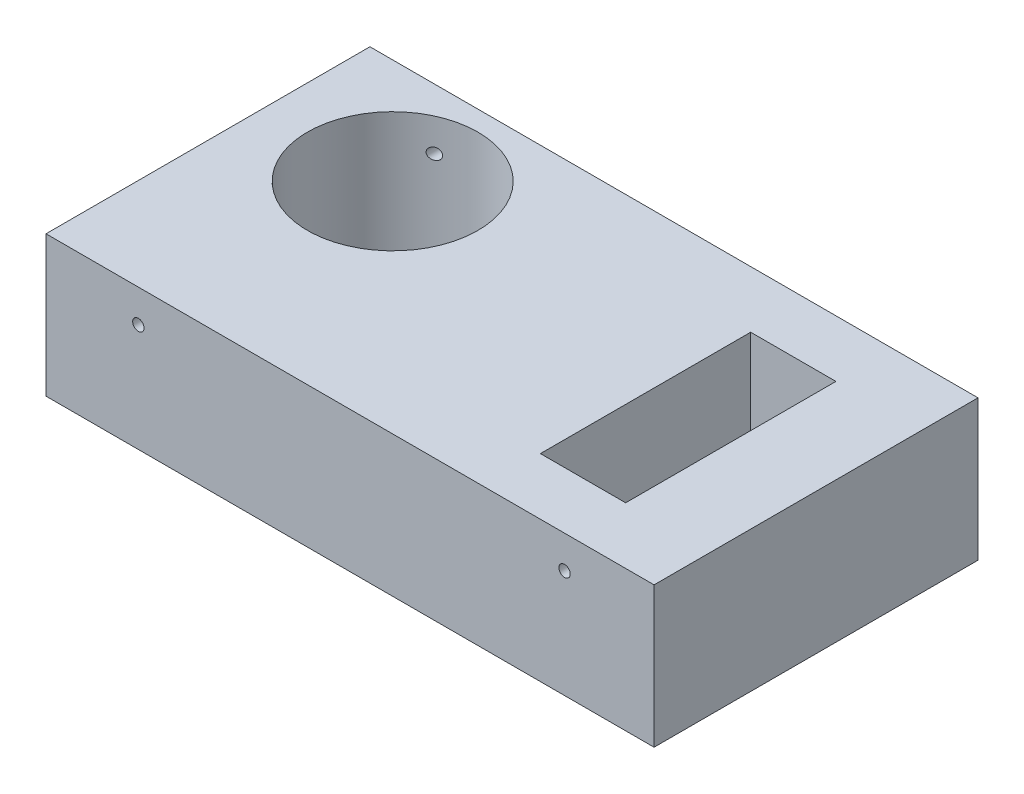
ISO-10303-21;
HEADER;
FILE_DESCRIPTION(('STEP AP214'),'2;1');
FILE_NAME('part.step','',(''),(''),'','','');
FILE_SCHEMA(('AUTOMOTIVE_DESIGN { 1 0 10303 214 1 1 1 1 }'));
ENDSEC;
DATA;
#1=APPLICATION_CONTEXT('core data for automotive mechanical design processes');
#2=APPLICATION_PROTOCOL_DEFINITION('international standard','automotive_design',2000,#1);
#3=PRODUCT_CONTEXT('',#1,'mechanical');
#4=PRODUCT('Part','Part','',(#3));
#5=PRODUCT_RELATED_PRODUCT_CATEGORY('part','',(#4));
#6=PRODUCT_DEFINITION_FORMATION('','',#4);
#7=PRODUCT_DEFINITION_CONTEXT('part definition',#1,'design');
#8=PRODUCT_DEFINITION('design','',#6,#7);
#9=PRODUCT_DEFINITION_SHAPE('','',#8);
#10=(LENGTH_UNIT() NAMED_UNIT(*) SI_UNIT(.MILLI.,.METRE.));
#11=(NAMED_UNIT(*) PLANE_ANGLE_UNIT() SI_UNIT($,.RADIAN.));
#12=(NAMED_UNIT(*) SI_UNIT($,.STERADIAN.) SOLID_ANGLE_UNIT());
#13=UNCERTAINTY_MEASURE_WITH_UNIT(LENGTH_MEASURE(1.E-05),#10,'distance_accuracy_value','');
#14=(GEOMETRIC_REPRESENTATION_CONTEXT(3) GLOBAL_UNCERTAINTY_ASSIGNED_CONTEXT((#13)) GLOBAL_UNIT_ASSIGNED_CONTEXT((#10,
#11,#12)) REPRESENTATION_CONTEXT('',''));
#15=CARTESIAN_POINT('',(0.,0.,0.));
#16=DIRECTION('',(0.,0.,1.));
#17=DIRECTION('',(1.,0.,0.));
#18=AXIS2_PLACEMENT_3D('',#15,#16,#17);
#19=CARTESIAN_POINT('',(-74.5,38.,-57.));
#20=DIRECTION('',(0.,0.,1.));
#21=DIRECTION('',(1.,0.,0.));
#22=AXIS2_PLACEMENT_3D('',#19,#20,#21);
#23=CYLINDRICAL_SURFACE('',#22,2.);
#24=CARTESIAN_POINT('',(-72.5,38.,-48.1024909927928));
#25=CARTESIAN_POINT('',(-72.5000056127034,38.1068105963611,-48.1024894733248));
#26=CARTESIAN_POINT('',(-72.5085948775076,38.2137087221724,-48.099284309105));
#27=CARTESIAN_POINT('',(-72.542644536427,38.4244839565528,-48.086526348822));
#28=CARTESIAN_POINT('',(-72.5681273016563,38.528356868335,-48.0769651357536));
#29=CARTESIAN_POINT('',(-72.6349270820288,38.7298974904715,-48.0517305985634));
#30=CARTESIAN_POINT('',(-72.6762181491416,38.8275750653049,-48.0360672897944));
#31=CARTESIAN_POINT('',(-72.7730883590107,39.0143195367713,-47.9989864741368));
#32=CARTESIAN_POINT('',(-72.8286647496488,39.1033880874202,-47.9775700755655));
#33=CARTESIAN_POINT('',(-72.9536044493678,39.2727882928728,-47.9288942215367));
#34=CARTESIAN_POINT('',(-73.0232554409855,39.3528719008664,-47.9015117122593));
#35=CARTESIAN_POINT('',(-73.1731843923079,39.5002054545406,-47.8418112846216));
#36=CARTESIAN_POINT('',(-73.2534649972934,39.5674521954393,-47.809492137423));
#37=CARTESIAN_POINT('',(-73.4273127272977,39.6915731698348,-47.7385262745004));
#38=CARTESIAN_POINT('',(-73.5213876833981,39.747584727054,-47.6996164880381));
#39=CARTESIAN_POINT('',(-73.7159739713687,39.8431124296659,-47.6178764353686));
#40=CARTESIAN_POINT('',(-73.8164873829994,39.8826232136434,-47.5750449004135));
#41=CARTESIAN_POINT('',(-74.0290113072431,39.9471536479172,-47.4830358817776));
#42=CARTESIAN_POINT('',(-74.1413183187928,39.9708619646823,-47.4336233885277));
#43=CARTESIAN_POINT('',(-74.3673056697825,39.9988420071326,-47.3324915932754));
#44=CARTESIAN_POINT('',(-74.4809864786952,40.0031068885515,-47.2807714854399));
#45=CARTESIAN_POINT('',(-74.714652104531,39.9921132853729,-47.1726936531268));
#46=CARTESIAN_POINT('',(-74.8345397299533,39.9755070433443,-47.1162597778908));
#47=CARTESIAN_POINT('',(-75.0695829966468,39.9209736893644,-47.0037589377087));
#48=CARTESIAN_POINT('',(-75.1847371296545,39.8830398373099,-46.9476920944239));
#49=CARTESIAN_POINT('',(-75.4101331906761,39.7852565968269,-46.8362542376786));
#50=CARTESIAN_POINT('',(-75.5201659963428,39.724856559226,-46.7809403985997));
#51=CARTESIAN_POINT('',(-75.7284597542595,39.5832671137464,-46.6747645794766));
#52=CARTESIAN_POINT('',(-75.8267215801068,39.502079250066,-46.6239022691323));
#53=CARTESIAN_POINT('',(-76.0032177774427,39.324841738461,-46.531478435245));
#54=CARTESIAN_POINT('',(-76.0821952919949,39.2297102704239,-46.4895842386537));
#55=CARTESIAN_POINT('',(-76.2223918439986,39.0241095852412,-46.4145776678624));
#56=CARTESIAN_POINT('',(-76.2836288633816,38.9136560678446,-46.3814564042756));
#57=CARTESIAN_POINT('',(-76.3789317192191,38.6944067568777,-46.3296208065032));
#58=CARTESIAN_POINT('',(-76.4153323455532,38.5869178208387,-46.3096773508127));
#59=CARTESIAN_POINT('',(-76.4694984426928,38.3660196410399,-46.2799276152804));
#60=CARTESIAN_POINT('',(-76.4872808293211,38.252615869811,-46.2701121336651));
#61=CARTESIAN_POINT('',(-76.5022572674949,38.0367680655252,-46.2618465710126));
#62=CARTESIAN_POINT('',(-76.5015180078515,37.9345051599056,-46.2622556018571));
#63=CARTESIAN_POINT('',(-76.4845294927676,37.7316905178097,-46.2716291808615));
#64=CARTESIAN_POINT('',(-76.4682831042526,37.6311384685313,-46.2805921475877));
#65=CARTESIAN_POINT('',(-76.4217631365352,37.4374390568907,-46.3061479075728));
#66=CARTESIAN_POINT('',(-76.3918982435422,37.3441628222261,-46.3225183033207));
#67=CARTESIAN_POINT('',(-76.3195591869826,37.1641657180482,-46.3619406217194));
#68=CARTESIAN_POINT('',(-76.2770825718231,37.0774461271972,-46.3849938434242));
#69=CARTESIAN_POINT('',(-76.1780233205035,36.9070441306898,-46.4383623444547));
#70=CARTESIAN_POINT('',(-76.1207212362753,36.8238962351896,-46.4690433158174));
#71=CARTESIAN_POINT('',(-75.9955196193249,36.6683073338,-46.5354564945736));
#72=CARTESIAN_POINT('',(-75.9276156739259,36.5958708107225,-46.5711908046672));
#73=CARTESIAN_POINT('',(-75.7749481734836,36.4551854433538,-46.6506847329327));
#74=CARTESIAN_POINT('',(-75.6891479596976,36.3883163713602,-46.6948949361927));
#75=CARTESIAN_POINT('',(-75.5090951176056,36.2698686449878,-46.7864623158284));
#76=CARTESIAN_POINT('',(-75.4148385103075,36.2182972382965,-46.833820970904));
#77=CARTESIAN_POINT('',(-75.2096862191802,36.1264261641185,-46.935452885468));
#78=CARTESIAN_POINT('',(-75.0980873881237,36.0879107863192,-46.9899255513877));
#79=CARTESIAN_POINT('',(-74.8700891089434,36.031028240575,-47.0993877131313));
#80=CARTESIAN_POINT('',(-74.7536879304836,36.0126684018396,-47.1543773896311));
#81=CARTESIAN_POINT('',(-74.5128332186841,35.996216017944,-47.266234076445));
#82=CARTESIAN_POINT('',(-74.3882770217627,35.9992341213327,-47.3230487800696));
#83=CARTESIAN_POINT('',(-74.1406773910373,36.0285982015083,-47.4339635143828));
#84=CARTESIAN_POINT('',(-74.0176339489535,36.0549440505573,-47.4880635599346));
#85=CARTESIAN_POINT('',(-73.7794304024233,36.1302227644743,-47.590968155543));
#86=CARTESIAN_POINT('',(-73.6641621306163,36.1786955927902,-47.6398566779816));
#87=CARTESIAN_POINT('',(-73.4430391443645,36.297483610714,-47.7321330753951));
#88=CARTESIAN_POINT('',(-73.3371800795979,36.3677886379845,-47.7755234963934));
#89=CARTESIAN_POINT('',(-73.1461832848353,36.5230926572186,-47.8526925705777));
#90=CARTESIAN_POINT('',(-73.0601126536933,36.6067139135694,-47.8869321047809));
#91=CARTESIAN_POINT('',(-72.9033687338432,36.7895282776041,-47.9485896115793));
#92=CARTESIAN_POINT('',(-72.8326917819407,36.8887176708901,-47.9760092073188));
#93=CARTESIAN_POINT('',(-72.7147876777399,37.0913341506252,-48.0213670923189));
#94=CARTESIAN_POINT('',(-72.6661550941848,37.1938171060871,-48.039880761022));
#95=CARTESIAN_POINT('',(-72.5867904302692,37.4063318634364,-48.0699428590612));
#96=CARTESIAN_POINT('',(-72.5560256795857,37.5163494740742,-48.0815040020788));
#97=CARTESIAN_POINT('',(-72.523270688475,37.6894657937011,-48.0937877217409));
#98=CARTESIAN_POINT('',(-72.5145580092062,37.7511944120497,-48.097048037903));
#99=CARTESIAN_POINT('',(-72.5029210910092,37.8752720782812,-48.1014000927768));
#100=CARTESIAN_POINT('',(-72.4999967221024,37.9376211122008,-48.1024918801835));
#101=CARTESIAN_POINT('',(-72.5,38.,-48.1024909927928));
#102=B_SPLINE_CURVE_WITH_KNOTS('',3,(#24,#25,#26,#27,#28,#29,#30,#31,#32,#33,#34,#35,#36,#37,
#38,#39,#40,#41,#42,#43,#44,#45,#46,#47,#48,#49,#50,#51,#52,#53,#54,#55,#56,#57,#58,#59,#60,#61,
#62,#63,#64,#65,#66,#67,#68,#69,#70,#71,#72,#73,#74,#75,#76,#77,#78,#79,#80,#81,#82,#83,#84,#85,
#86,#87,#88,#89,#90,#91,#92,#93,#94,#95,#96,#97,#98,#99,#100,#101),.UNSPECIFIED.,.T.,.F.,(4,2,2,
2,2,2,2,2,2,2,2,2,2,2,2,2,2,2,2,2,2,2,2,2,2,2,2,2,2,2,2,2,2,2,2,2,2,2,4),(0.,0.320196004599555,
0.64081687605138,0.960913715464976,1.28094893325264,1.60834448581735,1.93582166757088,
2.28291617373074,2.6301233699205,3.00340936515054,3.37682675030547,3.77564483413141,
4.17458902619155,4.58403564543533,4.99345185825504,5.38289609278711,5.77194419070073,
6.11565397504358,6.45905120607149,6.76432143054009,7.06953522821976,7.36613791902195,
7.66279830421986,7.97812655947618,8.29358641137877,8.64441033894374,8.99540021444058,
9.38375337810962,9.77224771288921,10.1810681736855,10.5898863958795,10.9905670301465,
11.3910614365513,11.7634451577615,12.1357401667161,12.4788054654525,12.8212414976707,
13.0082446588918,13.1952436208406),.UNSPECIFIED.);
#103=CARTESIAN_POINT('',(-72.5,38.,-48.1024909927928));
#104=VERTEX_POINT('',#103);
#105=EDGE_CURVE('E158',#104,#104,#102,.T.);
#106=ORIENTED_EDGE('',*,*,#105,.T.);
#107=EDGE_LOOP('',(#106));
#108=FACE_BOUND('',#107,.T.);
#109=CARTESIAN_POINT('',(-74.5,38.,-57.));
#110=DIRECTION('',(0.,0.,1.));
#111=DIRECTION('',(1.,0.,0.));
#112=AXIS2_PLACEMENT_3D('',#109,#110,#111);
#113=CIRCLE('',#112,2.);
#114=CARTESIAN_POINT('',(-72.5,38.,-57.));
#115=VERTEX_POINT('',#114);
#116=EDGE_CURVE('E172',#115,#115,#113,.T.);
#117=ORIENTED_EDGE('',*,*,#116,.F.);
#118=EDGE_LOOP('',(#117));
#119=FACE_BOUND('',#118,.T.);
#120=ADVANCED_FACE('F38',(#108,#119),#23,.F.);
#121=CARTESIAN_POINT('',(-107.,49.5,-57.));
#122=DIRECTION('',(1.,0.,0.));
#123=DIRECTION('',(0.,0.,-1.));
#124=AXIS2_PLACEMENT_3D('',#121,#122,#123);
#125=PLANE('',#124);
#126=DIRECTION('',(0.,0.,1.));
#127=VECTOR('',#126,1.);
#128=CARTESIAN_POINT('',(-107.,0.,-57.));
#129=LINE('',#128,#127);
#130=CARTESIAN_POINT('',(-107.,0.,-57.));
#131=VERTEX_POINT('',#130);
#132=CARTESIAN_POINT('',(-107.,0.,57.));
#133=VERTEX_POINT('',#132);
#134=EDGE_CURVE('E176',#131,#133,#129,.T.);
#135=ORIENTED_EDGE('',*,*,#134,.T.);
#136=DIRECTION('',(0.,-1.,0.));
#137=VECTOR('',#136,1.);
#138=CARTESIAN_POINT('',(-107.,49.5,57.));
#139=LINE('',#138,#137);
#140=CARTESIAN_POINT('',(-107.,49.5,57.));
#141=VERTEX_POINT('',#140);
#142=EDGE_CURVE('E225',#141,#133,#139,.T.);
#143=ORIENTED_EDGE('',*,*,#142,.F.);
#144=DIRECTION('',(0.,0.,1.));
#145=VECTOR('',#144,1.);
#146=CARTESIAN_POINT('',(-107.,49.5,-57.));
#147=LINE('',#146,#145);
#148=CARTESIAN_POINT('',(-107.,49.5,-57.));
#149=VERTEX_POINT('',#148);
#150=EDGE_CURVE('E188',#149,#141,#147,.T.);
#151=ORIENTED_EDGE('',*,*,#150,.F.);
#152=DIRECTION('',(0.,-1.,0.));
#153=VECTOR('',#152,1.);
#154=CARTESIAN_POINT('',(-107.,49.5,-57.));
#155=LINE('',#154,#153);
#156=EDGE_CURVE('E202',#149,#131,#155,.T.);
#157=ORIENTED_EDGE('',*,*,#156,.T.);
#158=EDGE_LOOP('',(#135,#143,#151,#157));
#159=FACE_BOUND('',#158,.T.);
#160=ADVANCED_FACE('F40',(#159),#125,.F.);
#161=CARTESIAN_POINT('',(107.,49.5,57.));
#162=DIRECTION('',(0.,0.,-1.));
#163=DIRECTION('',(-1.,0.,0.));
#164=AXIS2_PLACEMENT_3D('',#161,#162,#163);
#165=PLANE('',#164);
#166=CARTESIAN_POINT('',(-74.5,38.,57.));
#167=DIRECTION('',(0.,0.,1.));
#168=DIRECTION('',(1.,0.,0.));
#169=AXIS2_PLACEMENT_3D('',#166,#167,#168);
#170=CIRCLE('',#169,2.);
#171=CARTESIAN_POINT('',(-72.5,38.,57.));
#172=VERTEX_POINT('',#171);
#173=EDGE_CURVE('E177',#172,#172,#170,.T.);
#174=ORIENTED_EDGE('',*,*,#173,.F.);
#175=EDGE_LOOP('',(#174));
#176=FACE_BOUND('',#175,.T.);
#177=CARTESIAN_POINT('',(75.5,38.,57.));
#178=DIRECTION('',(0.,0.,1.));
#179=DIRECTION('',(1.,0.,0.));
#180=AXIS2_PLACEMENT_3D('',#177,#178,#179);
#181=CIRCLE('',#180,2.);
#182=CARTESIAN_POINT('',(77.5,38.,57.));
#183=VERTEX_POINT('',#182);
#184=EDGE_CURVE('E171',#183,#183,#181,.T.);
#185=ORIENTED_EDGE('',*,*,#184,.F.);
#186=EDGE_LOOP('',(#185));
#187=FACE_BOUND('',#186,.T.);
#188=DIRECTION('',(1.,0.,0.));
#189=VECTOR('',#188,1.);
#190=CARTESIAN_POINT('',(107.,0.,57.));
#191=LINE('',#190,#189);
#192=CARTESIAN_POINT('',(107.,0.,57.));
#193=VERTEX_POINT('',#192);
#194=EDGE_CURVE('E206',#133,#193,#191,.T.);
#195=ORIENTED_EDGE('',*,*,#194,.T.);
#196=DIRECTION('',(0.,-1.,0.));
#197=VECTOR('',#196,1.);
#198=CARTESIAN_POINT('',(107.,49.5,57.));
#199=LINE('',#198,#197);
#200=CARTESIAN_POINT('',(107.,49.5,57.));
#201=VERTEX_POINT('',#200);
#202=EDGE_CURVE('E221',#201,#193,#199,.T.);
#203=ORIENTED_EDGE('',*,*,#202,.F.);
#204=DIRECTION('',(1.,0.,0.));
#205=VECTOR('',#204,1.);
#206=CARTESIAN_POINT('',(107.,49.5,57.));
#207=LINE('',#206,#205);
#208=EDGE_CURVE('E192',#141,#201,#207,.T.);
#209=ORIENTED_EDGE('',*,*,#208,.F.);
#210=ORIENTED_EDGE('',*,*,#142,.T.);
#211=EDGE_LOOP('',(#195,#203,#209,#210));
#212=FACE_BOUND('',#211,.T.);
#213=ADVANCED_FACE('F276',(#176,#187,#212),#165,.F.);
#214=CARTESIAN_POINT('',(107.,49.5,-57.));
#215=DIRECTION('',(-1.,0.,0.));
#216=DIRECTION('',(0.,0.,1.));
#217=AXIS2_PLACEMENT_3D('',#214,#215,#216);
#218=PLANE('',#217);
#219=DIRECTION('',(0.,0.,-1.));
#220=VECTOR('',#219,1.);
#221=CARTESIAN_POINT('',(107.,0.,-57.));
#222=LINE('',#221,#220);
#223=CARTESIAN_POINT('',(107.,0.,-57.));
#224=VERTEX_POINT('',#223);
#225=EDGE_CURVE('E209',#193,#224,#222,.T.);
#226=ORIENTED_EDGE('',*,*,#225,.T.);
#227=DIRECTION('',(0.,-1.,0.));
#228=VECTOR('',#227,1.);
#229=CARTESIAN_POINT('',(107.,49.5,-57.));
#230=LINE('',#229,#228);
#231=CARTESIAN_POINT('',(107.,49.5,-57.));
#232=VERTEX_POINT('',#231);
#233=EDGE_CURVE('E217',#232,#224,#230,.T.);
#234=ORIENTED_EDGE('',*,*,#233,.F.);
#235=DIRECTION('',(0.,0.,-1.));
#236=VECTOR('',#235,1.);
#237=CARTESIAN_POINT('',(107.,49.5,-57.));
#238=LINE('',#237,#236);
#239=EDGE_CURVE('E196',#201,#232,#238,.T.);
#240=ORIENTED_EDGE('',*,*,#239,.F.);
#241=ORIENTED_EDGE('',*,*,#202,.T.);
#242=EDGE_LOOP('',(#226,#234,#240,#241));
#243=FACE_BOUND('',#242,.T.);
#244=ADVANCED_FACE('F294',(#243),#218,.F.);
#245=CARTESIAN_POINT('',(107.,49.5,-57.));
#246=DIRECTION('',(0.,0.,1.));
#247=DIRECTION('',(1.,0.,0.));
#248=AXIS2_PLACEMENT_3D('',#245,#246,#247);
#249=PLANE('',#248);
#250=ORIENTED_EDGE('',*,*,#116,.T.);
#251=EDGE_LOOP('',(#250));
#252=FACE_BOUND('',#251,.T.);
#253=CARTESIAN_POINT('',(75.5,38.,-57.));
#254=DIRECTION('',(0.,0.,1.));
#255=DIRECTION('',(1.,0.,0.));
#256=AXIS2_PLACEMENT_3D('',#253,#254,#255);
#257=CIRCLE('',#256,2.);
#258=CARTESIAN_POINT('',(77.5,38.,-57.));
#259=VERTEX_POINT('',#258);
#260=EDGE_CURVE('E181',#259,#259,#257,.T.);
#261=ORIENTED_EDGE('',*,*,#260,.T.);
#262=EDGE_LOOP('',(#261));
#263=FACE_BOUND('',#262,.T.);
#264=DIRECTION('',(-1.,0.,0.));
#265=VECTOR('',#264,1.);
#266=CARTESIAN_POINT('',(107.,0.,-57.));
#267=LINE('',#266,#265);
#268=EDGE_CURVE('E193',#224,#131,#267,.T.);
#269=ORIENTED_EDGE('',*,*,#268,.T.);
#270=ORIENTED_EDGE('',*,*,#156,.F.);
#271=DIRECTION('',(-1.,0.,0.));
#272=VECTOR('',#271,1.);
#273=CARTESIAN_POINT('',(107.,49.5,-57.));
#274=LINE('',#273,#272);
#275=EDGE_CURVE('E199',#232,#149,#274,.T.);
#276=ORIENTED_EDGE('',*,*,#275,.F.);
#277=ORIENTED_EDGE('',*,*,#233,.T.);
#278=EDGE_LOOP('',(#269,#270,#276,#277));
#279=FACE_BOUND('',#278,.T.);
#280=ADVANCED_FACE('F307',(#252,#263,#279),#249,.F.);
#281=CARTESIAN_POINT('',(0.,49.5,0.));
#282=DIRECTION('',(0.,-1.,0.));
#283=DIRECTION('',(0.,0.,-1.));
#284=AXIS2_PLACEMENT_3D('',#281,#282,#283);
#285=PLANE('',#284);
#286=CARTESIAN_POINT('',(-62.,49.5,-20.));
#287=DIRECTION('',(0.,-1.,0.));
#288=DIRECTION('',(0.,0.,-1.));
#289=AXIS2_PLACEMENT_3D('',#286,#287,#288);
#290=CIRCLE('',#289,30.);
#291=CARTESIAN_POINT('',(-62.,49.5,-50.));
#292=VERTEX_POINT('',#291);
#293=EDGE_CURVE('E153',#292,#292,#290,.T.);
#294=ORIENTED_EDGE('',*,*,#293,.T.);
#295=EDGE_LOOP('',(#294));
#296=FACE_BOUND('',#295,.T.);
#297=DIRECTION('',(1.,0.,0.));
#298=VECTOR('',#297,1.);
#299=CARTESIAN_POINT('',(0.,49.5,-37.));
#300=LINE('',#299,#298);
#301=CARTESIAN_POINT('',(47.,49.5,-37.));
#302=VERTEX_POINT('',#301);
#303=CARTESIAN_POINT('',(77.,49.5,-37.));
#304=VERTEX_POINT('',#303);
#305=EDGE_CURVE('E161',#302,#304,#300,.T.);
#306=ORIENTED_EDGE('',*,*,#305,.T.);
#307=DIRECTION('',(0.,0.,1.));
#308=VECTOR('',#307,1.);
#309=CARTESIAN_POINT('',(77.,49.5,0.));
#310=LINE('',#309,#308);
#311=CARTESIAN_POINT('',(77.,49.5,37.));
#312=VERTEX_POINT('',#311);
#313=EDGE_CURVE('E165',#304,#312,#310,.T.);
#314=ORIENTED_EDGE('',*,*,#313,.T.);
#315=DIRECTION('',(-1.,0.,0.));
#316=VECTOR('',#315,1.);
#317=CARTESIAN_POINT('',(0.,49.5,37.));
#318=LINE('',#317,#316);
#319=CARTESIAN_POINT('',(47.,49.5,37.));
#320=VERTEX_POINT('',#319);
#321=EDGE_CURVE('E157',#312,#320,#318,.T.);
#322=ORIENTED_EDGE('',*,*,#321,.T.);
#323=DIRECTION('',(0.,0.,-1.));
#324=VECTOR('',#323,1.);
#325=CARTESIAN_POINT('',(47.,49.5,0.));
#326=LINE('',#325,#324);
#327=EDGE_CURVE('E122',#320,#302,#326,.T.);
#328=ORIENTED_EDGE('',*,*,#327,.T.);
#329=EDGE_LOOP('',(#306,#314,#322,#328));
#330=FACE_BOUND('',#329,.T.);
#331=ORIENTED_EDGE('',*,*,#150,.T.);
#332=ORIENTED_EDGE('',*,*,#208,.T.);
#333=ORIENTED_EDGE('',*,*,#239,.T.);
#334=ORIENTED_EDGE('',*,*,#275,.T.);
#335=EDGE_LOOP('',(#331,#332,#333,#334));
#336=FACE_BOUND('',#335,.T.);
#337=ADVANCED_FACE('F311',(#296,#330,#336),#285,.F.);
#338=CARTESIAN_POINT('',(0.,0.,0.));
#339=DIRECTION('',(0.,-1.,0.));
#340=DIRECTION('',(0.,0.,-1.));
#341=AXIS2_PLACEMENT_3D('',#338,#339,#340);
#342=PLANE('',#341);
#343=CARTESIAN_POINT('',(-62.,0.,-20.));
#344=DIRECTION('',(0.,-1.,0.));
#345=DIRECTION('',(0.,0.,-1.));
#346=AXIS2_PLACEMENT_3D('',#343,#344,#345);
#347=CIRCLE('',#346,30.);
#348=CARTESIAN_POINT('',(-62.,0.,-50.));
#349=VERTEX_POINT('',#348);
#350=EDGE_CURVE('E239',#349,#349,#347,.T.);
#351=ORIENTED_EDGE('',*,*,#350,.F.);
#352=EDGE_LOOP('',(#351));
#353=FACE_BOUND('',#352,.T.);
#354=DIRECTION('',(0.,0.,1.));
#355=VECTOR('',#354,1.);
#356=CARTESIAN_POINT('',(77.,0.,37.));
#357=LINE('',#356,#355);
#358=CARTESIAN_POINT('',(77.,0.,-37.));
#359=VERTEX_POINT('',#358);
#360=CARTESIAN_POINT('',(77.,0.,37.));
#361=VERTEX_POINT('',#360);
#362=EDGE_CURVE('E62',#359,#361,#357,.T.);
#363=ORIENTED_EDGE('',*,*,#362,.F.);
#364=DIRECTION('',(1.,0.,0.));
#365=VECTOR('',#364,1.);
#366=CARTESIAN_POINT('',(77.,0.,-37.));
#367=LINE('',#366,#365);
#368=CARTESIAN_POINT('',(47.,0.,-37.));
#369=VERTEX_POINT('',#368);
#370=EDGE_CURVE('E138',#369,#359,#367,.T.);
#371=ORIENTED_EDGE('',*,*,#370,.F.);
#372=DIRECTION('',(0.,0.,-1.));
#373=VECTOR('',#372,1.);
#374=CARTESIAN_POINT('',(47.,0.,37.));
#375=LINE('',#374,#373);
#376=CARTESIAN_POINT('',(47.,0.,37.));
#377=VERTEX_POINT('',#376);
#378=EDGE_CURVE('E119',#377,#369,#375,.T.);
#379=ORIENTED_EDGE('',*,*,#378,.F.);
#380=DIRECTION('',(-1.,0.,0.));
#381=VECTOR('',#380,1.);
#382=CARTESIAN_POINT('',(77.,0.,37.));
#383=LINE('',#382,#381);
#384=EDGE_CURVE('E129',#361,#377,#383,.T.);
#385=ORIENTED_EDGE('',*,*,#384,.F.);
#386=EDGE_LOOP('',(#363,#371,#379,#385));
#387=FACE_BOUND('',#386,.T.);
#388=ORIENTED_EDGE('',*,*,#134,.F.);
#389=ORIENTED_EDGE('',*,*,#268,.F.);
#390=ORIENTED_EDGE('',*,*,#225,.F.);
#391=ORIENTED_EDGE('',*,*,#194,.F.);
#392=EDGE_LOOP('',(#388,#389,#390,#391));
#393=FACE_BOUND('',#392,.T.);
#394=ADVANCED_FACE('F135',(#353,#387,#393),#342,.T.);
#395=CARTESIAN_POINT('',(75.5,38.,-57.));
#396=DIRECTION('',(0.,0.,1.));
#397=DIRECTION('',(1.,0.,0.));
#398=AXIS2_PLACEMENT_3D('',#395,#396,#397);
#399=CYLINDRICAL_SURFACE('',#398,2.);
#400=DIRECTION('',(0.,0.,1.));
#401=VECTOR('',#400,1.);
#402=CARTESIAN_POINT('',(77.,39.3228756555323,-57.));
#403=LINE('',#402,#401);
#404=CARTESIAN_POINT('',(77.,39.3228756555323,37.));
#405=VERTEX_POINT('',#404);
#406=CARTESIAN_POINT('',(77.,39.3228756555323,-37.));
#407=VERTEX_POINT('',#406);
#408=EDGE_CURVE('E47',#405,#407,#403,.F.);
#409=ORIENTED_EDGE('',*,*,#408,.T.);
#410=CARTESIAN_POINT('',(75.5,38.,-37.));
#411=DIRECTION('',(0.,0.,-1.));
#412=DIRECTION('',(-1.,0.,0.));
#413=AXIS2_PLACEMENT_3D('',#410,#411,#412);
#414=CIRCLE('',#413,2.);
#415=CARTESIAN_POINT('',(77.,36.6771243444677,-37.));
#416=VERTEX_POINT('',#415);
#417=EDGE_CURVE('E11',#407,#416,#414,.F.);
#418=ORIENTED_EDGE('',*,*,#417,.T.);
#419=DIRECTION('',(0.,0.,1.));
#420=VECTOR('',#419,1.);
#421=CARTESIAN_POINT('',(77.,36.6771243444677,-57.));
#422=LINE('',#421,#420);
#423=CARTESIAN_POINT('',(77.,36.6771243444677,37.));
#424=VERTEX_POINT('',#423);
#425=EDGE_CURVE('E423',#416,#424,#422,.T.);
#426=ORIENTED_EDGE('',*,*,#425,.T.);
#427=CARTESIAN_POINT('',(75.5,38.,37.));
#428=DIRECTION('',(0.,0.,1.));
#429=DIRECTION('',(1.,0.,0.));
#430=AXIS2_PLACEMENT_3D('',#427,#428,#429);
#431=CIRCLE('',#430,2.);
#432=EDGE_CURVE('E229',#424,#405,#431,.F.);
#433=ORIENTED_EDGE('',*,*,#432,.T.);
#434=EDGE_LOOP('',(#409,#418,#426,#433));
#435=FACE_BOUND('',#434,.T.);
#436=ORIENTED_EDGE('',*,*,#260,.F.);
#437=EDGE_LOOP('',(#436));
#438=FACE_BOUND('',#437,.T.);
#439=ORIENTED_EDGE('',*,*,#184,.T.);
#440=EDGE_LOOP('',(#439));
#441=FACE_BOUND('',#440,.T.);
#442=ADVANCED_FACE('F281',(#435,#438,#441),#399,.F.);
#443=CARTESIAN_POINT('',(-72.5,38.,8.10249099279278));
#444=CARTESIAN_POINT('',(-72.5000056127034,37.8931894036389,8.10248947332474));
#445=CARTESIAN_POINT('',(-72.5085948775076,37.7862912778276,8.09928430910496));
#446=CARTESIAN_POINT('',(-72.542644536427,37.5755160434472,8.08652634882196));
#447=CARTESIAN_POINT('',(-72.5681273016563,37.471643131665,8.07696513575355));
#448=CARTESIAN_POINT('',(-72.6349270820288,37.2701025095285,8.05173059856336));
#449=CARTESIAN_POINT('',(-72.6762181491416,37.1724249346951,8.03606728979434));
#450=CARTESIAN_POINT('',(-72.7730883590107,36.9856804632287,7.99898647413677));
#451=CARTESIAN_POINT('',(-72.8286647496488,36.8966119125798,7.97757007556549));
#452=CARTESIAN_POINT('',(-72.9536044493678,36.7272117071272,7.92889422153667));
#453=CARTESIAN_POINT('',(-73.0232554409855,36.6471280991336,7.90151171225932));
#454=CARTESIAN_POINT('',(-73.1731843923079,36.4997945454594,7.84181128462152));
#455=CARTESIAN_POINT('',(-73.2534649972934,36.4325478045607,7.80949213742294));
#456=CARTESIAN_POINT('',(-73.4273127272977,36.3084268301652,7.7385262745004));
#457=CARTESIAN_POINT('',(-73.5213876833981,36.252415272946,7.6996164880381));
#458=CARTESIAN_POINT('',(-73.7159739713687,36.1568875703341,7.61787643536854));
#459=CARTESIAN_POINT('',(-73.8164873829994,36.1173767863566,7.57504490041345));
#460=CARTESIAN_POINT('',(-74.0290113072431,36.0528463520828,7.48303588177758));
#461=CARTESIAN_POINT('',(-74.1413183187928,36.0291380353177,7.43362338852763));
#462=CARTESIAN_POINT('',(-74.3673056697825,36.0011579928674,7.33249159327539));
#463=CARTESIAN_POINT('',(-74.4809864786952,35.9968931114485,7.28077148543989));
#464=CARTESIAN_POINT('',(-74.714652104531,36.0078867146271,7.17269365312676));
#465=CARTESIAN_POINT('',(-74.8345397299533,36.0244929566557,7.11625977789081));
#466=CARTESIAN_POINT('',(-75.0695829966468,36.0790263106356,7.00375893770863));
#467=CARTESIAN_POINT('',(-75.1847371296545,36.1169601626901,6.94769209442381));
#468=CARTESIAN_POINT('',(-75.4101331906761,36.2147434031731,6.83625423767854));
#469=CARTESIAN_POINT('',(-75.5201659963428,36.275143440774,6.78094039859971));
#470=CARTESIAN_POINT('',(-75.7284597542595,36.4167328862536,6.67476457947656));
#471=CARTESIAN_POINT('',(-75.8267215801068,36.497920749934,6.62390226913225));
#472=CARTESIAN_POINT('',(-76.0032177774427,36.675158261539,6.53147843524492));
#473=CARTESIAN_POINT('',(-76.0821952919949,36.7702897295761,6.48958423865364));
#474=CARTESIAN_POINT('',(-76.2223918439986,36.9758904147588,6.41457766786232));
#475=CARTESIAN_POINT('',(-76.2836288633816,37.0863439321554,6.38145640427554));
#476=CARTESIAN_POINT('',(-76.3789317192191,37.3055932431223,6.32962080650313));
#477=CARTESIAN_POINT('',(-76.4153323455532,37.4130821791613,6.30967735081265));
#478=CARTESIAN_POINT('',(-76.4694984426928,37.6339803589601,6.27992761528031));
#479=CARTESIAN_POINT('',(-76.4872808293211,37.747384130189,6.27011213366502));
#480=CARTESIAN_POINT('',(-76.5022572674949,37.9632319344748,6.26184657101256));
#481=CARTESIAN_POINT('',(-76.5015180078515,38.0654948400944,6.26225560185707));
#482=CARTESIAN_POINT('',(-76.4845294927676,38.2683094821903,6.27162918086151));
#483=CARTESIAN_POINT('',(-76.4682831042526,38.3688615314687,6.28059214758768));
#484=CARTESIAN_POINT('',(-76.4217631365352,38.5625609431093,6.30614790757275));
#485=CARTESIAN_POINT('',(-76.3918982435422,38.6558371777739,6.32251830332067));
#486=CARTESIAN_POINT('',(-76.3195591869826,38.8358342819518,6.36194062171935));
#487=CARTESIAN_POINT('',(-76.2770825718231,38.9225538728028,6.38499384342418));
#488=CARTESIAN_POINT('',(-76.1780233205035,39.0929558693102,6.43836234445465));
#489=CARTESIAN_POINT('',(-76.1207212362753,39.1761037648104,6.46904331581735));
#490=CARTESIAN_POINT('',(-75.9955196193249,39.3316926662,6.53545649457356));
#491=CARTESIAN_POINT('',(-75.9276156739259,39.4041291892775,6.57119080466711));
#492=CARTESIAN_POINT('',(-75.7749481734836,39.5448145566462,6.65068473293269));
#493=CARTESIAN_POINT('',(-75.6891479596976,39.6116836286398,6.69489493619271));
#494=CARTESIAN_POINT('',(-75.5090951176056,39.7301313550122,6.78646231582838));
#495=CARTESIAN_POINT('',(-75.4148385103075,39.7817027617035,6.83382097090392));
#496=CARTESIAN_POINT('',(-75.2096862191802,39.8735738358815,6.93545288546794));
#497=CARTESIAN_POINT('',(-75.0980873881237,39.9120892136808,6.9899255513877));
#498=CARTESIAN_POINT('',(-74.8700891089434,39.968971759425,7.0993877131313));
#499=CARTESIAN_POINT('',(-74.7536879304836,39.9873315981604,7.15437738963103));
#500=CARTESIAN_POINT('',(-74.5128332186841,40.003783982056,7.26623407644492));
#501=CARTESIAN_POINT('',(-74.3882770217627,40.0007658786673,7.32304878006955));
#502=CARTESIAN_POINT('',(-74.1406773910373,39.9714017984917,7.43396351438277));
#503=CARTESIAN_POINT('',(-74.0176339489535,39.9450559494427,7.48806355993456));
#504=CARTESIAN_POINT('',(-73.7794304024233,39.8697772355257,7.59096815554297));
#505=CARTESIAN_POINT('',(-73.6641621306163,39.8213044072098,7.63985667798155));
#506=CARTESIAN_POINT('',(-73.4430391443645,39.702516389286,7.73213307539502));
#507=CARTESIAN_POINT('',(-73.3371800795979,39.6322113620155,7.77552349639333));
#508=CARTESIAN_POINT('',(-73.1461832848353,39.4769073427814,7.8526925705777));
#509=CARTESIAN_POINT('',(-73.0601126536933,39.3932860864305,7.88693210478089));
#510=CARTESIAN_POINT('',(-72.9033687338432,39.2104717223959,7.94858961157927));
#511=CARTESIAN_POINT('',(-72.8326917819407,39.1112823291099,7.97600920731872));
#512=CARTESIAN_POINT('',(-72.7147876777399,38.9086658493748,8.02136709231887));
#513=CARTESIAN_POINT('',(-72.6661550941848,38.8061828939129,8.03988076102191));
#514=CARTESIAN_POINT('',(-72.5867904302692,38.5936681365636,8.06994285906119));
#515=CARTESIAN_POINT('',(-72.5560256795857,38.4836505259258,8.08150400207877));
#516=CARTESIAN_POINT('',(-72.523270688475,38.3105342062989,8.09378772174082));
#517=CARTESIAN_POINT('',(-72.5145580092062,38.2488055879503,8.09704803790297));
#518=CARTESIAN_POINT('',(-72.5029210910092,38.1247279217188,8.10140009277673));
#519=CARTESIAN_POINT('',(-72.4999967221024,38.0623788877992,8.10249188018344));
#520=CARTESIAN_POINT('',(-72.5,38.,8.10249099279278));
#521=B_SPLINE_CURVE_WITH_KNOTS('',3,(#443,#444,#445,#446,#447,#448,#449,#450,#451,#452,#453,
#454,#455,#456,#457,#458,#459,#460,#461,#462,#463,#464,#465,#466,#467,#468,#469,#470,#471,#472,
#473,#474,#475,#476,#477,#478,#479,#480,#481,#482,#483,#484,#485,#486,#487,#488,#489,#490,#491,
#492,#493,#494,#495,#496,#497,#498,#499,#500,#501,#502,#503,#504,#505,#506,#507,#508,#509,#510,
#511,#512,#513,#514,#515,#516,#517,#518,#519,#520),.UNSPECIFIED.,.T.,.F.,(4,2,2,2,2,2,2,2,2,2,2,
2,2,2,2,2,2,2,2,2,2,2,2,2,2,2,2,2,2,2,2,2,2,2,2,2,2,2,4),(0.,0.320196004599555,0.64081687605138,
0.960913715464976,1.28094893325264,1.60834448581737,1.93582166757088,2.28291617373074,
2.6301233699205,3.00340936515054,3.37682675030547,3.7756448341314,4.17458902619155,
4.58403564543533,4.99345185825504,5.38289609278711,5.77194419070073,6.11565397504358,
6.45905120607149,6.76432143054009,7.06953522821976,7.36613791902195,7.66279830421986,
7.97812655947618,8.29358641137877,8.64441033894374,8.99540021444058,9.38375337810962,
9.77224771288921,10.1810681736855,10.5898863958795,10.9905670301465,11.3910614365513,
11.7634451577615,12.1357401667161,12.4788054654525,12.8212414976707,13.0082446588918,
13.1952436208406),.UNSPECIFIED.);
#522=CARTESIAN_POINT('',(-72.5,38.,8.10249099279278));
#523=VERTEX_POINT('',#522);
#524=EDGE_CURVE('E230',#523,#523,#521,.T.);
#525=ORIENTED_EDGE('',*,*,#524,.T.);
#526=EDGE_LOOP('',(#525));
#527=FACE_BOUND('',#526,.T.);
#528=ORIENTED_EDGE('',*,*,#173,.T.);
#529=EDGE_LOOP('',(#528));
#530=FACE_BOUND('',#529,.T.);
#531=ADVANCED_FACE('F244',(#527,#530),#23,.F.);
#532=CARTESIAN_POINT('',(-62.,55.,-20.));
#533=DIRECTION('',(0.,-1.,0.));
#534=DIRECTION('',(0.,0.,-1.));
#535=AXIS2_PLACEMENT_3D('',#532,#533,#534);
#536=CYLINDRICAL_SURFACE('',#535,30.);
#537=ORIENTED_EDGE('',*,*,#105,.F.);
#538=EDGE_LOOP('',(#537));
#539=FACE_BOUND('',#538,.T.);
#540=ORIENTED_EDGE('',*,*,#350,.T.);
#541=EDGE_LOOP('',(#540));
#542=FACE_BOUND('',#541,.T.);
#543=ORIENTED_EDGE('',*,*,#524,.F.);
#544=EDGE_LOOP('',(#543));
#545=FACE_BOUND('',#544,.T.);
#546=ORIENTED_EDGE('',*,*,#293,.F.);
#547=EDGE_LOOP('',(#546));
#548=FACE_BOUND('',#547,.T.);
#549=ADVANCED_FACE('F248',(#539,#542,#545,#548),#536,.F.);
#550=CARTESIAN_POINT('',(47.,55.,37.));
#551=DIRECTION('',(-1.,0.,0.));
#552=DIRECTION('',(0.,0.,1.));
#553=AXIS2_PLACEMENT_3D('',#550,#551,#552);
#554=PLANE('',#553);
#555=DIRECTION('',(0.,-1.,0.));
#556=VECTOR('',#555,1.);
#557=CARTESIAN_POINT('',(47.,55.,37.));
#558=LINE('',#557,#556);
#559=EDGE_CURVE('E54',#320,#377,#558,.T.);
#560=ORIENTED_EDGE('',*,*,#559,.T.);
#561=ORIENTED_EDGE('',*,*,#378,.T.);
#562=DIRECTION('',(0.,-1.,0.));
#563=VECTOR('',#562,1.);
#564=CARTESIAN_POINT('',(47.,55.,-37.));
#565=LINE('',#564,#563);
#566=EDGE_CURVE('E125',#302,#369,#565,.T.);
#567=ORIENTED_EDGE('',*,*,#566,.F.);
#568=ORIENTED_EDGE('',*,*,#327,.F.);
#569=EDGE_LOOP('',(#560,#561,#567,#568));
#570=FACE_BOUND('',#569,.T.);
#571=ADVANCED_FACE('F116',(#570),#554,.F.);
#572=CARTESIAN_POINT('',(77.,55.,37.));
#573=DIRECTION('',(1.,0.,0.));
#574=DIRECTION('',(0.,0.,-1.));
#575=AXIS2_PLACEMENT_3D('',#572,#573,#574);
#576=PLANE('',#575);
#577=DIRECTION('',(0.,-1.,0.));
#578=VECTOR('',#577,1.);
#579=CARTESIAN_POINT('',(77.,55.,-37.));
#580=LINE('',#579,#578);
#581=EDGE_CURVE('E148',#304,#407,#580,.T.);
#582=ORIENTED_EDGE('',*,*,#581,.T.);
#583=ORIENTED_EDGE('',*,*,#408,.F.);
#584=DIRECTION('',(0.,-1.,0.));
#585=VECTOR('',#584,1.);
#586=CARTESIAN_POINT('',(77.,55.,37.));
#587=LINE('',#586,#585);
#588=EDGE_CURVE('E126',#312,#405,#587,.T.);
#589=ORIENTED_EDGE('',*,*,#588,.F.);
#590=ORIENTED_EDGE('',*,*,#313,.F.);
#591=EDGE_LOOP('',(#582,#583,#589,#590));
#592=FACE_BOUND('',#591,.T.);
#593=ADVANCED_FACE('F261',(#592),#576,.F.);
#594=EDGE_CURVE('E145',#416,#359,#580,.T.);
#595=ORIENTED_EDGE('',*,*,#594,.T.);
#596=ORIENTED_EDGE('',*,*,#362,.T.);
#597=EDGE_CURVE('E131',#424,#361,#587,.T.);
#598=ORIENTED_EDGE('',*,*,#597,.F.);
#599=ORIENTED_EDGE('',*,*,#425,.F.);
#600=EDGE_LOOP('',(#595,#596,#598,#599));
#601=FACE_BOUND('',#600,.T.);
#602=ADVANCED_FACE('F257',(#601),#576,.F.);
#603=CARTESIAN_POINT('',(77.,55.,-37.));
#604=DIRECTION('',(0.,0.,-1.));
#605=DIRECTION('',(-1.,0.,0.));
#606=AXIS2_PLACEMENT_3D('',#603,#604,#605);
#607=PLANE('',#606);
#608=ORIENTED_EDGE('',*,*,#566,.T.);
#609=ORIENTED_EDGE('',*,*,#370,.T.);
#610=ORIENTED_EDGE('',*,*,#594,.F.);
#611=ORIENTED_EDGE('',*,*,#417,.F.);
#612=ORIENTED_EDGE('',*,*,#581,.F.);
#613=ORIENTED_EDGE('',*,*,#305,.F.);
#614=EDGE_LOOP('',(#608,#609,#610,#611,#612,#613));
#615=FACE_BOUND('',#614,.T.);
#616=ADVANCED_FACE('F253',(#615),#607,.F.);
#617=CARTESIAN_POINT('',(77.,55.,37.));
#618=DIRECTION('',(0.,0.,1.));
#619=DIRECTION('',(1.,0.,0.));
#620=AXIS2_PLACEMENT_3D('',#617,#618,#619);
#621=PLANE('',#620);
#622=ORIENTED_EDGE('',*,*,#588,.T.);
#623=ORIENTED_EDGE('',*,*,#432,.F.);
#624=ORIENTED_EDGE('',*,*,#597,.T.);
#625=ORIENTED_EDGE('',*,*,#384,.T.);
#626=ORIENTED_EDGE('',*,*,#559,.F.);
#627=ORIENTED_EDGE('',*,*,#321,.F.);
#628=EDGE_LOOP('',(#622,#623,#624,#625,#626,#627));
#629=FACE_BOUND('',#628,.T.);
#630=ADVANCED_FACE('F130',(#629),#621,.F.);
#631=CLOSED_SHELL('',(#120,#160,#213,#244,#280,#337,#394,#442,#531,#549,#571,#593,#602,#616,#630));
#632=MANIFOLD_SOLID_BREP('B2',#631);
#633=ADVANCED_BREP_SHAPE_REPRESENTATION('',(#18,#632),#14);
#634=SHAPE_DEFINITION_REPRESENTATION(#9,#633);
ENDSEC;
END-ISO-10303-21;
